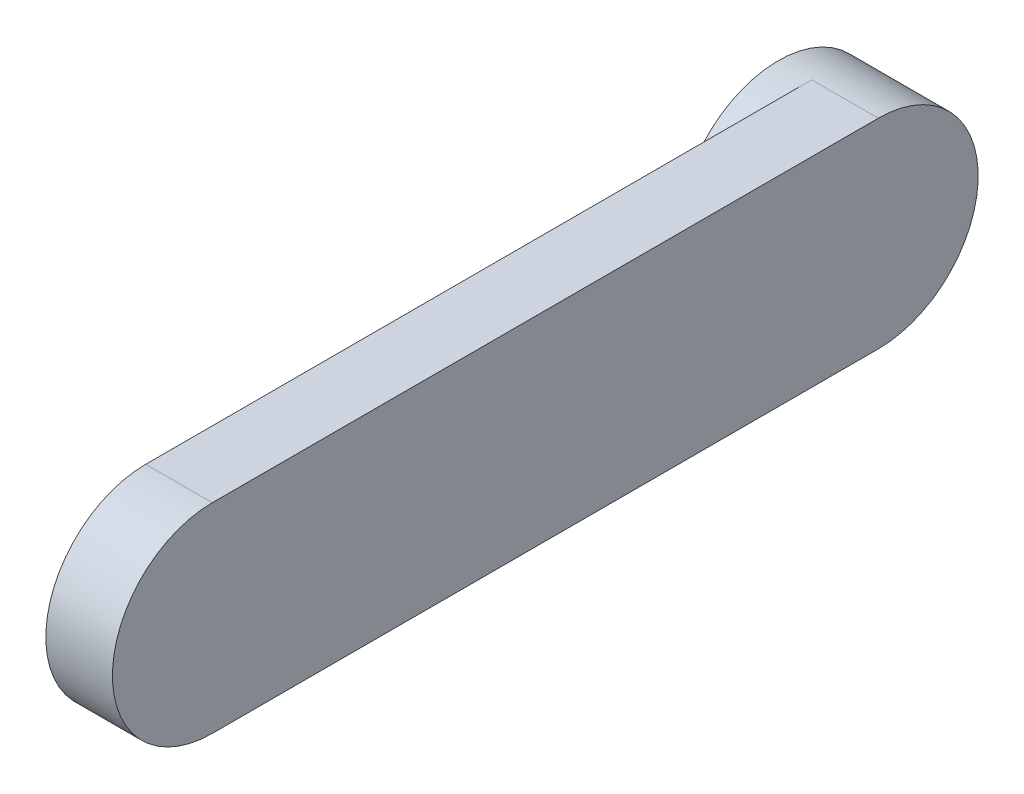
ISO-10303-21;
HEADER;
FILE_DESCRIPTION(('STEP AP214'),'2;1');
FILE_NAME('part.step','',(''),(''),'','','');
FILE_SCHEMA(('AUTOMOTIVE_DESIGN { 1 0 10303 214 1 1 1 1 }'));
ENDSEC;
DATA;
#1=APPLICATION_CONTEXT('core data for automotive mechanical design processes');
#2=APPLICATION_PROTOCOL_DEFINITION('international standard','automotive_design',2000,#1);
#3=PRODUCT_CONTEXT('',#1,'mechanical');
#4=PRODUCT('Part','Part','',(#3));
#5=PRODUCT_RELATED_PRODUCT_CATEGORY('part','',(#4));
#6=PRODUCT_DEFINITION_FORMATION('','',#4);
#7=PRODUCT_DEFINITION_CONTEXT('part definition',#1,'design');
#8=PRODUCT_DEFINITION('design','',#6,#7);
#9=PRODUCT_DEFINITION_SHAPE('','',#8);
#10=(LENGTH_UNIT() NAMED_UNIT(*) SI_UNIT(.MILLI.,.METRE.));
#11=(NAMED_UNIT(*) PLANE_ANGLE_UNIT() SI_UNIT($,.RADIAN.));
#12=(NAMED_UNIT(*) SI_UNIT($,.STERADIAN.) SOLID_ANGLE_UNIT());
#13=UNCERTAINTY_MEASURE_WITH_UNIT(LENGTH_MEASURE(1.E-05),#10,'distance_accuracy_value','');
#14=(GEOMETRIC_REPRESENTATION_CONTEXT(3) GLOBAL_UNCERTAINTY_ASSIGNED_CONTEXT((#13)) GLOBAL_UNIT_ASSIGNED_CONTEXT((#10,
#11,#12)) REPRESENTATION_CONTEXT('',''));
#15=CARTESIAN_POINT('',(0.,0.,0.));
#16=DIRECTION('',(0.,0.,1.));
#17=DIRECTION('',(1.,0.,0.));
#18=AXIS2_PLACEMENT_3D('',#15,#16,#17);
#19=CARTESIAN_POINT('',(20.,0.,0.));
#20=DIRECTION('',(-1.,0.,0.));
#21=DIRECTION('',(0.,0.,1.));
#22=AXIS2_PLACEMENT_3D('',#19,#20,#21);
#23=CYLINDRICAL_SURFACE('',#22,30.);
#24=DIRECTION('',(-1.,0.,0.));
#25=VECTOR('',#24,1.);
#26=CARTESIAN_POINT('',(20.,-30.,0.));
#27=LINE('',#26,#25);
#28=CARTESIAN_POINT('',(20.,-30.,0.));
#29=VERTEX_POINT('',#28);
#30=CARTESIAN_POINT('',(0.,-30.,0.));
#31=VERTEX_POINT('',#30);
#32=EDGE_CURVE('E101',#29,#31,#27,.T.);
#33=ORIENTED_EDGE('',*,*,#32,.T.);
#34=CARTESIAN_POINT('',(0.,0.,0.));
#35=DIRECTION('',(-1.,0.,0.));
#36=DIRECTION('',(0.,0.,1.));
#37=AXIS2_PLACEMENT_3D('',#34,#35,#36);
#38=CIRCLE('',#37,30.);
#39=CARTESIAN_POINT('',(0.,30.,0.));
#40=VERTEX_POINT('',#39);
#41=EDGE_CURVE('E11',#31,#40,#38,.T.);
#42=ORIENTED_EDGE('',*,*,#41,.T.);
#43=DIRECTION('',(-1.,0.,0.));
#44=VECTOR('',#43,1.);
#45=CARTESIAN_POINT('',(20.,30.,0.));
#46=LINE('',#45,#44);
#47=CARTESIAN_POINT('',(20.,30.,0.));
#48=VERTEX_POINT('',#47);
#49=EDGE_CURVE('E42',#48,#40,#46,.T.);
#50=ORIENTED_EDGE('',*,*,#49,.F.);
#51=CARTESIAN_POINT('',(20.,0.,0.));
#52=DIRECTION('',(1.,0.,0.));
#53=DIRECTION('',(0.,0.,1.));
#54=AXIS2_PLACEMENT_3D('',#51,#52,#53);
#55=CIRCLE('',#54,30.);
#56=EDGE_CURVE('E102',#29,#48,#55,.T.);
#57=ORIENTED_EDGE('',*,*,#56,.F.);
#58=EDGE_LOOP('',(#33,#42,#50,#57));
#59=FACE_BOUND('',#58,.T.);
#60=CARTESIAN_POINT('',(-10.,0.,0.));
#61=DIRECTION('',(-1.,0.,0.));
#62=DIRECTION('',(0.,0.,1.));
#63=AXIS2_PLACEMENT_3D('',#60,#61,#62);
#64=CIRCLE('',#63,30.);
#65=CARTESIAN_POINT('',(-10.,0.,30.));
#66=VERTEX_POINT('',#65);
#67=EDGE_CURVE('E97',#66,#66,#64,.T.);
#68=ORIENTED_EDGE('',*,*,#67,.F.);
#69=EDGE_LOOP('',(#68));
#70=FACE_BOUND('',#69,.T.);
#71=ADVANCED_FACE('F39',(#59,#70),#23,.T.);
#72=CARTESIAN_POINT('',(20.,30.,0.));
#73=DIRECTION('',(0.,-1.,0.));
#74=DIRECTION('',(0.,0.,-1.));
#75=AXIS2_PLACEMENT_3D('',#72,#73,#74);
#76=PLANE('',#75);
#77=DIRECTION('',(0.,0.,1.));
#78=VECTOR('',#77,1.);
#79=CARTESIAN_POINT('',(0.,30.,0.));
#80=LINE('',#79,#78);
#81=CARTESIAN_POINT('',(0.,30.,200.));
#82=VERTEX_POINT('',#81);
#83=EDGE_CURVE('E90',#40,#82,#80,.T.);
#84=ORIENTED_EDGE('',*,*,#83,.T.);
#85=DIRECTION('',(-1.,0.,0.));
#86=VECTOR('',#85,1.);
#87=CARTESIAN_POINT('',(20.,30.,200.));
#88=LINE('',#87,#86);
#89=CARTESIAN_POINT('',(20.,30.,200.));
#90=VERTEX_POINT('',#89);
#91=EDGE_CURVE('E94',#90,#82,#88,.T.);
#92=ORIENTED_EDGE('',*,*,#91,.F.);
#93=DIRECTION('',(0.,0.,1.));
#94=VECTOR('',#93,1.);
#95=CARTESIAN_POINT('',(20.,30.,0.));
#96=LINE('',#95,#94);
#97=EDGE_CURVE('E86',#48,#90,#96,.T.);
#98=ORIENTED_EDGE('',*,*,#97,.F.);
#99=ORIENTED_EDGE('',*,*,#49,.T.);
#100=EDGE_LOOP('',(#84,#92,#98,#99));
#101=FACE_BOUND('',#100,.T.);
#102=ADVANCED_FACE('F89',(#101),#76,.F.);
#103=CARTESIAN_POINT('',(20.,0.,200.));
#104=DIRECTION('',(-1.,0.,0.));
#105=DIRECTION('',(0.,0.,1.));
#106=AXIS2_PLACEMENT_3D('',#103,#104,#105);
#107=CYLINDRICAL_SURFACE('',#106,30.);
#108=CARTESIAN_POINT('',(0.,0.,200.));
#109=DIRECTION('',(1.,0.,0.));
#110=DIRECTION('',(0.,0.,-1.));
#111=AXIS2_PLACEMENT_3D('',#108,#109,#110);
#112=CIRCLE('',#111,30.);
#113=CARTESIAN_POINT('',(0.,-30.,200.));
#114=VERTEX_POINT('',#113);
#115=EDGE_CURVE('E72',#82,#114,#112,.T.);
#116=ORIENTED_EDGE('',*,*,#115,.T.);
#117=DIRECTION('',(-1.,0.,0.));
#118=VECTOR('',#117,1.);
#119=CARTESIAN_POINT('',(20.,-30.,200.));
#120=LINE('',#119,#118);
#121=CARTESIAN_POINT('',(20.,-30.,200.));
#122=VERTEX_POINT('',#121);
#123=EDGE_CURVE('E105',#122,#114,#120,.T.);
#124=ORIENTED_EDGE('',*,*,#123,.F.);
#125=CARTESIAN_POINT('',(20.,0.,200.));
#126=DIRECTION('',(1.,0.,0.));
#127=DIRECTION('',(0.,0.,-1.));
#128=AXIS2_PLACEMENT_3D('',#125,#126,#127);
#129=CIRCLE('',#128,30.);
#130=EDGE_CURVE('E110',#90,#122,#129,.T.);
#131=ORIENTED_EDGE('',*,*,#130,.F.);
#132=ORIENTED_EDGE('',*,*,#91,.T.);
#133=EDGE_LOOP('',(#116,#124,#131,#132));
#134=FACE_BOUND('',#133,.T.);
#135=ADVANCED_FACE('F117',(#134),#107,.T.);
#136=CARTESIAN_POINT('',(20.,-30.,0.));
#137=DIRECTION('',(0.,1.,0.));
#138=DIRECTION('',(0.,0.,1.));
#139=AXIS2_PLACEMENT_3D('',#136,#137,#138);
#140=PLANE('',#139);
#141=DIRECTION('',(0.,0.,-1.));
#142=VECTOR('',#141,1.);
#143=CARTESIAN_POINT('',(0.,-30.,0.));
#144=LINE('',#143,#142);
#145=EDGE_CURVE('E113',#114,#31,#144,.T.);
#146=ORIENTED_EDGE('',*,*,#145,.T.);
#147=ORIENTED_EDGE('',*,*,#32,.F.);
#148=DIRECTION('',(0.,0.,-1.));
#149=VECTOR('',#148,1.);
#150=CARTESIAN_POINT('',(20.,-30.,0.));
#151=LINE('',#150,#149);
#152=EDGE_CURVE('E57',#122,#29,#151,.T.);
#153=ORIENTED_EDGE('',*,*,#152,.F.);
#154=ORIENTED_EDGE('',*,*,#123,.T.);
#155=EDGE_LOOP('',(#146,#147,#153,#154));
#156=FACE_BOUND('',#155,.T.);
#157=ADVANCED_FACE('F139',(#156),#140,.F.);
#158=CARTESIAN_POINT('',(20.,0.,0.));
#159=DIRECTION('',(-1.,0.,0.));
#160=DIRECTION('',(0.,0.,1.));
#161=AXIS2_PLACEMENT_3D('',#158,#159,#160);
#162=PLANE('',#161);
#163=ORIENTED_EDGE('',*,*,#56,.T.);
#164=ORIENTED_EDGE('',*,*,#97,.T.);
#165=ORIENTED_EDGE('',*,*,#130,.T.);
#166=ORIENTED_EDGE('',*,*,#152,.T.);
#167=EDGE_LOOP('',(#163,#164,#165,#166));
#168=FACE_BOUND('',#167,.T.);
#169=ADVANCED_FACE('F144',(#168),#162,.F.);
#170=CARTESIAN_POINT('',(0.,0.,0.));
#171=DIRECTION('',(-1.,0.,0.));
#172=DIRECTION('',(0.,0.,1.));
#173=AXIS2_PLACEMENT_3D('',#170,#171,#172);
#174=PLANE('',#173);
#175=ORIENTED_EDGE('',*,*,#41,.F.);
#176=ORIENTED_EDGE('',*,*,#145,.F.);
#177=ORIENTED_EDGE('',*,*,#115,.F.);
#178=ORIENTED_EDGE('',*,*,#83,.F.);
#179=EDGE_LOOP('',(#175,#176,#177,#178));
#180=FACE_BOUND('',#179,.T.);
#181=ADVANCED_FACE('F95',(#180),#174,.T.);
#182=CARTESIAN_POINT('',(-10.,0.,0.));
#183=DIRECTION('',(-1.,0.,0.));
#184=DIRECTION('',(0.,0.,1.));
#185=AXIS2_PLACEMENT_3D('',#182,#183,#184);
#186=PLANE('',#185);
#187=ORIENTED_EDGE('',*,*,#67,.T.);
#188=EDGE_LOOP('',(#187));
#189=FACE_BOUND('',#188,.T.);
#190=ADVANCED_FACE('F131',(#189),#186,.T.);
#191=CLOSED_SHELL('',(#71,#102,#135,#157,#169,#181,#190));
#192=MANIFOLD_SOLID_BREP('B2',#191);
#193=ADVANCED_BREP_SHAPE_REPRESENTATION('',(#18,#192),#14);
#194=SHAPE_DEFINITION_REPRESENTATION(#9,#193);
ENDSEC;
END-ISO-10303-21;
